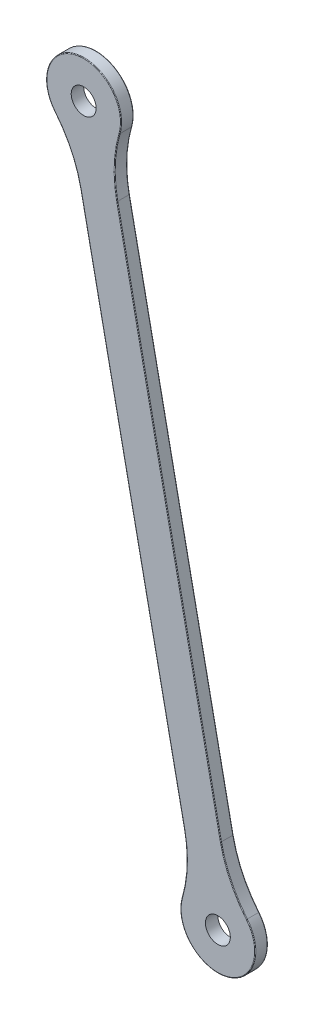
ISO-10303-21;
HEADER;
FILE_DESCRIPTION(('STEP AP214'),'2;1');
FILE_NAME('part.step','',(''),(''),'','','');
FILE_SCHEMA(('AUTOMOTIVE_DESIGN { 1 0 10303 214 1 1 1 1 }'));
ENDSEC;
DATA;
#1=APPLICATION_CONTEXT('core data for automotive mechanical design processes');
#2=APPLICATION_PROTOCOL_DEFINITION('international standard','automotive_design',2000,#1);
#3=PRODUCT_CONTEXT('',#1,'mechanical');
#4=PRODUCT('Part','Part','',(#3));
#5=PRODUCT_RELATED_PRODUCT_CATEGORY('part','',(#4));
#6=PRODUCT_DEFINITION_FORMATION('','',#4);
#7=PRODUCT_DEFINITION_CONTEXT('part definition',#1,'design');
#8=PRODUCT_DEFINITION('design','',#6,#7);
#9=PRODUCT_DEFINITION_SHAPE('','',#8);
#10=(LENGTH_UNIT() NAMED_UNIT(*) SI_UNIT(.MILLI.,.METRE.));
#11=(NAMED_UNIT(*) PLANE_ANGLE_UNIT() SI_UNIT($,.RADIAN.));
#12=(NAMED_UNIT(*) SI_UNIT($,.STERADIAN.) SOLID_ANGLE_UNIT());
#13=UNCERTAINTY_MEASURE_WITH_UNIT(LENGTH_MEASURE(1.E-05),#10,'distance_accuracy_value','');
#14=(GEOMETRIC_REPRESENTATION_CONTEXT(3) GLOBAL_UNCERTAINTY_ASSIGNED_CONTEXT((#13)) GLOBAL_UNIT_ASSIGNED_CONTEXT((#10,
#11,#12)) REPRESENTATION_CONTEXT('',''));
#15=CARTESIAN_POINT('',(0.,0.,0.));
#16=DIRECTION('',(0.,0.,1.));
#17=DIRECTION('',(1.,0.,0.));
#18=AXIS2_PLACEMENT_3D('',#15,#16,#17);
#19=CARTESIAN_POINT('',(39.2978914794172,8.10290704749419,-3.));
#20=DIRECTION('',(0.979397120277319,0.201943756507832,0.));
#21=DIRECTION('',(-0.201943756507832,0.979397120277319,0.));
#22=AXIS2_PLACEMENT_3D('',#19,#20,#21);
#23=PLANE('',#22);
#24=DIRECTION('',(0.,0.,1.));
#25=VECTOR('',#24,1.);
#26=CARTESIAN_POINT('',(25.6983866348893,74.0584785999702,-3.));
#27=LINE('',#26,#25);
#28=CARTESIAN_POINT('',(25.6983866348893,74.0584785999702,-2.85));
#29=VERTEX_POINT('',#28);
#30=CARTESIAN_POINT('',(25.6983866348893,74.0584785999702,-0.15));
#31=VERTEX_POINT('',#30);
#32=EDGE_CURVE('E283',#29,#31,#27,.T.);
#33=ORIENTED_EDGE('',*,*,#32,.T.);
#34=DIRECTION('',(-0.201943756507832,0.979397120277319,0.));
#35=VECTOR('',#34,1.);
#36=CARTESIAN_POINT('',(0.732699371036717,195.138340809095,-0.15));
#37=LINE('',#36,#35);
#38=CARTESIAN_POINT('',(0.732699371036753,195.138340809095,-0.15));
#39=VERTEX_POINT('',#38);
#40=EDGE_CURVE('E209',#31,#39,#37,.T.);
#41=ORIENTED_EDGE('',*,*,#40,.T.);
#42=DIRECTION('',(0.,0.,1.));
#43=VECTOR('',#42,1.);
#44=CARTESIAN_POINT('',(0.732699371036753,195.138340809095,-3.));
#45=LINE('',#44,#43);
#46=CARTESIAN_POINT('',(0.732699371036753,195.138340809095,-2.85));
#47=VERTEX_POINT('',#46);
#48=EDGE_CURVE('E278',#39,#47,#45,.F.);
#49=ORIENTED_EDGE('',*,*,#48,.T.);
#50=DIRECTION('',(-0.201943756507832,0.979397120277319,0.));
#51=VECTOR('',#50,1.);
#52=CARTESIAN_POINT('',(39.2978914794172,8.10290704749419,-2.85));
#53=LINE('',#52,#51);
#54=EDGE_CURVE('E207',#47,#29,#53,.F.);
#55=ORIENTED_EDGE('',*,*,#54,.T.);
#56=EDGE_LOOP('',(#33,#41,#49,#55));
#57=FACE_BOUND('',#56,.T.);
#58=ADVANCED_FACE('F34',(#57),#23,.F.);
#59=CARTESIAN_POINT('',(1.46732952358442,213.858926231003,-3.));
#60=DIRECTION('',(0.,0.,1.));
#61=DIRECTION('',(1.,0.,0.));
#62=AXIS2_PLACEMENT_3D('',#59,#60,#61);
#63=CYLINDRICAL_SURFACE('',#62,9.00000000000001);
#64=DIRECTION('',(0.,0.,1.));
#65=VECTOR('',#64,1.);
#66=CARTESIAN_POINT('',(-5.48264211353879,208.140718973201,-3.));
#67=LINE('',#66,#65);
#68=CARTESIAN_POINT('',(-5.48264211353879,208.140718973201,-2.85));
#69=VERTEX_POINT('',#68);
#70=CARTESIAN_POINT('',(-5.48264211353879,208.140718973201,-0.15));
#71=VERTEX_POINT('',#70);
#72=EDGE_CURVE('E167',#69,#71,#67,.T.);
#73=ORIENTED_EDGE('',*,*,#72,.T.);
#74=CARTESIAN_POINT('',(1.46732952358442,213.858926231003,-0.15));
#75=DIRECTION('',(0.,0.,1.));
#76=DIRECTION('',(1.,0.,0.));
#77=AXIS2_PLACEMENT_3D('',#74,#75,#76);
#78=CIRCLE('',#77,9.00000000000001);
#79=CARTESIAN_POINT('',(10.112373570877,211.35628494221,-0.15));
#80=VERTEX_POINT('',#79);
#81=EDGE_CURVE('E184',#71,#80,#78,.F.);
#82=ORIENTED_EDGE('',*,*,#81,.T.);
#83=DIRECTION('',(0.,0.,1.));
#84=VECTOR('',#83,1.);
#85=CARTESIAN_POINT('',(10.112373570877,211.35628494221,-3.));
#86=LINE('',#85,#84);
#87=CARTESIAN_POINT('',(10.112373570877,211.35628494221,-2.85));
#88=VERTEX_POINT('',#87);
#89=EDGE_CURVE('E286',#80,#88,#86,.F.);
#90=ORIENTED_EDGE('',*,*,#89,.T.);
#91=CARTESIAN_POINT('',(1.46732952358442,213.858926231003,-2.85));
#92=DIRECTION('',(0.,0.,1.));
#93=DIRECTION('',(1.,0.,0.));
#94=AXIS2_PLACEMENT_3D('',#91,#92,#93);
#95=CIRCLE('',#94,9.00000000000001);
#96=EDGE_CURVE('E182',#88,#69,#95,.T.);
#97=ORIENTED_EDGE('',*,*,#96,.T.);
#98=EDGE_LOOP('',(#73,#82,#90,#97));
#99=FACE_BOUND('',#98,.T.);
#100=ADVANCED_FACE('F314',(#99),#63,.T.);
#101=CARTESIAN_POINT('',(48.1124655619131,9.92040085606468,-3.));
#102=DIRECTION('',(0.979397120277319,0.201943756507832,0.));
#103=DIRECTION('',(-0.201943756507832,0.979397120277319,0.));
#104=AXIS2_PLACEMENT_3D('',#101,#102,#103);
#105=PLANE('',#104);
#106=DIRECTION('',(0.,0.,-1.));
#107=VECTOR('',#106,1.);
#108=CARTESIAN_POINT('',(9.54727345353264,196.955834617665,0.));
#109=LINE('',#108,#107);
#110=CARTESIAN_POINT('',(9.54727345353264,196.955834617665,-2.85));
#111=VERTEX_POINT('',#110);
#112=CARTESIAN_POINT('',(9.54727345353264,196.955834617665,-0.15));
#113=VERTEX_POINT('',#112);
#114=EDGE_CURVE('E289',#111,#113,#109,.F.);
#115=ORIENTED_EDGE('',*,*,#114,.T.);
#116=DIRECTION('',(-0.201943756507832,0.979397120277319,0.));
#117=VECTOR('',#116,1.);
#118=CARTESIAN_POINT('',(48.1124655619131,9.92040085606468,-0.15));
#119=LINE('',#118,#117);
#120=CARTESIAN_POINT('',(34.5129607173852,75.8759724085406,-0.15));
#121=VERTEX_POINT('',#120);
#122=EDGE_CURVE('E192',#113,#121,#119,.F.);
#123=ORIENTED_EDGE('',*,*,#122,.T.);
#124=DIRECTION('',(0.,0.,-1.));
#125=VECTOR('',#124,1.);
#126=CARTESIAN_POINT('',(34.5129607173852,75.8759724085406,-3.));
#127=LINE('',#126,#125);
#128=CARTESIAN_POINT('',(34.5129607173852,75.8759724085406,-2.85));
#129=VERTEX_POINT('',#128);
#130=EDGE_CURVE('E284',#121,#129,#127,.T.);
#131=ORIENTED_EDGE('',*,*,#130,.T.);
#132=DIRECTION('',(-0.201943756507832,0.979397120277319,0.));
#133=VECTOR('',#132,1.);
#134=CARTESIAN_POINT('',(9.5472734535326,196.955834617666,-2.85));
#135=LINE('',#134,#133);
#136=EDGE_CURVE('E190',#129,#111,#135,.T.);
#137=ORIENTED_EDGE('',*,*,#136,.T.);
#138=EDGE_LOOP('',(#115,#123,#131,#137));
#139=FACE_BOUND('',#138,.T.);
#140=ADVANCED_FACE('F386',(#139),#105,.T.);
#141=CARTESIAN_POINT('',(33.7783305648375,57.1553869866323,-3.));
#142=DIRECTION('',(0.,0.,1.));
#143=DIRECTION('',(1.,0.,0.));
#144=AXIS2_PLACEMENT_3D('',#141,#142,#143);
#145=CYLINDRICAL_SURFACE('',#144,9.);
#146=DIRECTION('',(0.,0.,1.));
#147=VECTOR('',#146,1.);
#148=CARTESIAN_POINT('',(40.7283022019607,62.8735942444346,-3.));
#149=LINE('',#148,#147);
#150=CARTESIAN_POINT('',(40.7283022019607,62.8735942444346,-2.85));
#151=VERTEX_POINT('',#150);
#152=CARTESIAN_POINT('',(40.7283022019607,62.8735942444346,-0.15));
#153=VERTEX_POINT('',#152);
#154=EDGE_CURVE('E347',#151,#153,#149,.T.);
#155=ORIENTED_EDGE('',*,*,#154,.T.);
#156=CARTESIAN_POINT('',(33.7783305648375,57.1553869866323,-0.15));
#157=DIRECTION('',(0.,0.,1.));
#158=DIRECTION('',(1.,0.,0.));
#159=AXIS2_PLACEMENT_3D('',#156,#157,#158);
#160=CIRCLE('',#159,9.);
#161=CARTESIAN_POINT('',(25.1332865175449,59.6580282754253,-0.15));
#162=VERTEX_POINT('',#161);
#163=EDGE_CURVE('E201',#153,#162,#160,.F.);
#164=ORIENTED_EDGE('',*,*,#163,.T.);
#165=DIRECTION('',(0.,0.,1.));
#166=VECTOR('',#165,1.);
#167=CARTESIAN_POINT('',(25.1332865175449,59.6580282754253,-3.));
#168=LINE('',#167,#166);
#169=CARTESIAN_POINT('',(25.1332865175449,59.6580282754253,-2.85));
#170=VERTEX_POINT('',#169);
#171=EDGE_CURVE('E240',#162,#170,#168,.F.);
#172=ORIENTED_EDGE('',*,*,#171,.T.);
#173=CARTESIAN_POINT('',(33.7783305648375,57.1553869866323,-2.85));
#174=DIRECTION('',(0.,0.,1.));
#175=DIRECTION('',(1.,0.,0.));
#176=AXIS2_PLACEMENT_3D('',#173,#174,#175);
#177=CIRCLE('',#176,9.);
#178=EDGE_CURVE('E199',#170,#151,#177,.T.);
#179=ORIENTED_EDGE('',*,*,#178,.T.);
#180=EDGE_LOOP('',(#155,#164,#172,#179));
#181=FACE_BOUND('',#180,.T.);
#182=ADVANCED_FACE('F346',(#181),#145,.T.);
#183=CARTESIAN_POINT('',(0.,0.,-3.));
#184=DIRECTION('',(0.,0.,1.));
#185=DIRECTION('',(1.,0.,0.));
#186=AXIS2_PLACEMENT_3D('',#183,#184,#185);
#187=PLANE('',#186);
#188=DIRECTION('',(-0.201943756507832,0.979397120277319,0.));
#189=VECTOR('',#188,1.);
#190=CARTESIAN_POINT('',(34.3660511493436,75.8456808450645,-3.));
#191=LINE('',#190,#189);
#192=CARTESIAN_POINT('',(9.40036388549103,196.925543054189,-3.));
#193=VERTEX_POINT('',#192);
#194=CARTESIAN_POINT('',(34.3660511493436,75.8456808450644,-3.));
#195=VERTEX_POINT('',#194);
#196=EDGE_CURVE('E43',#193,#195,#191,.F.);
#197=ORIENTED_EDGE('',*,*,#196,.T.);
#198=CARTESIAN_POINT('',(63.8948743257047,81.9342851037755,-3.));
#199=DIRECTION('',(0.,0.,1.));
#200=DIRECTION('',(1.,0.,0.));
#201=AXIS2_PLACEMENT_3D('',#198,#199,#200);
#202=CIRCLE('',#201,30.15);
#203=CARTESIAN_POINT('',(40.612469341342,62.7782907901379,-3.));
#204=VERTEX_POINT('',#203);
#205=EDGE_CURVE('E11',#195,#204,#202,.T.);
#206=ORIENTED_EDGE('',*,*,#205,.T.);
#207=CARTESIAN_POINT('',(33.7783305648375,57.1553869866323,-3.));
#208=DIRECTION('',(0.,0.,1.));
#209=DIRECTION('',(1.,0.,0.));
#210=AXIS2_PLACEMENT_3D('',#207,#208,#209);
#211=CIRCLE('',#210,8.85);
#212=CARTESIAN_POINT('',(25.2773705849998,59.6163175872787,-3.));
#213=VERTEX_POINT('',#212);
#214=EDGE_CURVE('E211',#204,#213,#211,.F.);
#215=ORIENTED_EDGE('',*,*,#214,.T.);
#216=CARTESIAN_POINT('',(-3.6835269734303,68.0001659047352,-3.));
#217=DIRECTION('',(0.,0.,1.));
#218=DIRECTION('',(1.,0.,0.));
#219=AXIS2_PLACEMENT_3D('',#216,#217,#218);
#220=CIRCLE('',#219,30.15);
#221=CARTESIAN_POINT('',(25.8452962029309,74.0887701634463,-3.));
#222=VERTEX_POINT('',#221);
#223=EDGE_CURVE('E213',#213,#222,#220,.T.);
#224=ORIENTED_EDGE('',*,*,#223,.T.);
#225=DIRECTION('',(-0.201943756507832,0.979397120277319,0.));
#226=VECTOR('',#225,1.);
#227=CARTESIAN_POINT('',(39.4448010474588,8.13319861097037,-3.));
#228=LINE('',#227,#226);
#229=CARTESIAN_POINT('',(0.87960893907836,195.168632372571,-3.));
#230=VERTEX_POINT('',#229);
#231=EDGE_CURVE('E215',#222,#230,#228,.T.);
#232=ORIENTED_EDGE('',*,*,#231,.T.);
#233=CARTESIAN_POINT('',(-28.6492142372828,189.08002811386,-3.));
#234=DIRECTION('',(0.,0.,1.));
#235=DIRECTION('',(1.,0.,0.));
#236=AXIS2_PLACEMENT_3D('',#233,#234,#235);
#237=CIRCLE('',#236,30.15);
#238=CARTESIAN_POINT('',(-5.36680925292007,208.236022427498,-3.));
#239=VERTEX_POINT('',#238);
#240=EDGE_CURVE('E217',#230,#239,#237,.T.);
#241=ORIENTED_EDGE('',*,*,#240,.T.);
#242=CARTESIAN_POINT('',(1.46732952358442,213.858926231003,-3.));
#243=DIRECTION('',(0.,0.,1.));
#244=DIRECTION('',(1.,0.,0.));
#245=AXIS2_PLACEMENT_3D('',#242,#243,#244);
#246=CIRCLE('',#245,8.85);
#247=CARTESIAN_POINT('',(9.9682895034221,211.397995630357,-3.));
#248=VERTEX_POINT('',#247);
#249=EDGE_CURVE('E219',#239,#248,#246,.F.);
#250=ORIENTED_EDGE('',*,*,#249,.T.);
#251=CARTESIAN_POINT('',(38.9291870618522,203.0141473129,-3.));
#252=DIRECTION('',(0.,0.,1.));
#253=DIRECTION('',(1.,0.,0.));
#254=AXIS2_PLACEMENT_3D('',#251,#252,#253);
#255=CIRCLE('',#254,30.15);
#256=EDGE_CURVE('E54',#248,#193,#255,.T.);
#257=ORIENTED_EDGE('',*,*,#256,.T.);
#258=EDGE_LOOP('',(#197,#206,#215,#224,#232,#241,#250,#257));
#259=FACE_BOUND('',#258,.T.);
#260=CARTESIAN_POINT('',(1.46732952358442,213.858926231003,-3.));
#261=DIRECTION('',(0.,0.,1.));
#262=DIRECTION('',(1.,0.,0.));
#263=AXIS2_PLACEMENT_3D('',#260,#261,#262);
#264=CIRCLE('',#263,3.);
#265=CARTESIAN_POINT('',(4.46732952358442,213.858926231003,-3.));
#266=VERTEX_POINT('',#265);
#267=EDGE_CURVE('E244',#266,#266,#264,.F.);
#268=ORIENTED_EDGE('',*,*,#267,.F.);
#269=EDGE_LOOP('',(#268));
#270=FACE_BOUND('',#269,.T.);
#271=CARTESIAN_POINT('',(33.7783305648375,57.1553869866323,-3.));
#272=DIRECTION('',(0.,0.,1.));
#273=DIRECTION('',(1.,0.,0.));
#274=AXIS2_PLACEMENT_3D('',#271,#272,#273);
#275=CIRCLE('',#274,3.);
#276=CARTESIAN_POINT('',(36.7783305648375,57.1553869866323,-3.));
#277=VERTEX_POINT('',#276);
#278=EDGE_CURVE('E362',#277,#277,#275,.F.);
#279=ORIENTED_EDGE('',*,*,#278,.F.);
#280=EDGE_LOOP('',(#279));
#281=FACE_BOUND('',#280,.T.);
#282=ADVANCED_FACE('F331',(#259,#270,#281),#187,.F.);
#283=CARTESIAN_POINT('',(0.,0.,0.));
#284=DIRECTION('',(0.,0.,1.));
#285=DIRECTION('',(1.,0.,0.));
#286=AXIS2_PLACEMENT_3D('',#283,#284,#285);
#287=PLANE('',#286);
#288=CARTESIAN_POINT('',(1.46732952358442,213.858926231003,0.));
#289=DIRECTION('',(0.,0.,1.));
#290=DIRECTION('',(1.,0.,0.));
#291=AXIS2_PLACEMENT_3D('',#288,#289,#290);
#292=CIRCLE('',#291,8.85);
#293=CARTESIAN_POINT('',(9.96828950342212,211.397995630357,0.));
#294=VERTEX_POINT('',#293);
#295=CARTESIAN_POINT('',(-5.36680925292007,208.236022427498,0.));
#296=VERTEX_POINT('',#295);
#297=EDGE_CURVE('E172',#294,#296,#292,.T.);
#298=ORIENTED_EDGE('',*,*,#297,.T.);
#299=CARTESIAN_POINT('',(-28.6492142372828,189.08002811386,0.));
#300=DIRECTION('',(0.,0.,1.));
#301=DIRECTION('',(1.,0.,0.));
#302=AXIS2_PLACEMENT_3D('',#299,#300,#301);
#303=CIRCLE('',#302,30.15);
#304=CARTESIAN_POINT('',(0.879608939078351,195.168632372571,0.));
#305=VERTEX_POINT('',#304);
#306=EDGE_CURVE('E152',#296,#305,#303,.F.);
#307=ORIENTED_EDGE('',*,*,#306,.T.);
#308=DIRECTION('',(-0.201943756507832,0.979397120277319,0.));
#309=VECTOR('',#308,1.);
#310=CARTESIAN_POINT('',(25.8452962029309,74.0887701634464,0.));
#311=LINE('',#310,#309);
#312=CARTESIAN_POINT('',(25.8452962029309,74.0887701634463,0.));
#313=VERTEX_POINT('',#312);
#314=EDGE_CURVE('E160',#305,#313,#311,.F.);
#315=ORIENTED_EDGE('',*,*,#314,.T.);
#316=CARTESIAN_POINT('',(-3.6835269734303,68.0001659047352,0.));
#317=DIRECTION('',(0.,0.,1.));
#318=DIRECTION('',(1.,0.,0.));
#319=AXIS2_PLACEMENT_3D('',#316,#317,#318);
#320=CIRCLE('',#319,30.15);
#321=CARTESIAN_POINT('',(25.2773705849998,59.6163175872787,0.));
#322=VERTEX_POINT('',#321);
#323=EDGE_CURVE('E166',#313,#322,#320,.F.);
#324=ORIENTED_EDGE('',*,*,#323,.T.);
#325=CARTESIAN_POINT('',(33.7783305648375,57.1553869866323,0.));
#326=DIRECTION('',(0.,0.,1.));
#327=DIRECTION('',(1.,0.,0.));
#328=AXIS2_PLACEMENT_3D('',#325,#326,#327);
#329=CIRCLE('',#328,8.85);
#330=CARTESIAN_POINT('',(40.612469341342,62.7782907901379,0.));
#331=VERTEX_POINT('',#330);
#332=EDGE_CURVE('E297',#322,#331,#329,.T.);
#333=ORIENTED_EDGE('',*,*,#332,.T.);
#334=CARTESIAN_POINT('',(63.8948743257047,81.9342851037755,0.));
#335=DIRECTION('',(0.,0.,1.));
#336=DIRECTION('',(1.,0.,0.));
#337=AXIS2_PLACEMENT_3D('',#334,#335,#336);
#338=CIRCLE('',#337,30.15);
#339=CARTESIAN_POINT('',(34.3660511493436,75.8456808450644,0.));
#340=VERTEX_POINT('',#339);
#341=EDGE_CURVE('E299',#331,#340,#338,.F.);
#342=ORIENTED_EDGE('',*,*,#341,.T.);
#343=DIRECTION('',(-0.201943756507832,0.979397120277319,0.));
#344=VECTOR('',#343,1.);
#345=CARTESIAN_POINT('',(47.9655559938715,9.89010929258851,0.));
#346=LINE('',#345,#344);
#347=CARTESIAN_POINT('',(9.40036388549104,196.925543054189,0.));
#348=VERTEX_POINT('',#347);
#349=EDGE_CURVE('E301',#340,#348,#346,.T.);
#350=ORIENTED_EDGE('',*,*,#349,.T.);
#351=CARTESIAN_POINT('',(38.9291870618522,203.0141473129,0.));
#352=DIRECTION('',(0.,0.,1.));
#353=DIRECTION('',(1.,0.,0.));
#354=AXIS2_PLACEMENT_3D('',#351,#352,#353);
#355=CIRCLE('',#354,30.15);
#356=EDGE_CURVE('E177',#348,#294,#355,.F.);
#357=ORIENTED_EDGE('',*,*,#356,.T.);
#358=EDGE_LOOP('',(#298,#307,#315,#324,#333,#342,#350,#357));
#359=FACE_BOUND('',#358,.T.);
#360=CARTESIAN_POINT('',(1.46732952358442,213.858926231003,0.));
#361=DIRECTION('',(0.,0.,1.));
#362=DIRECTION('',(1.,0.,0.));
#363=AXIS2_PLACEMENT_3D('',#360,#361,#362);
#364=CIRCLE('',#363,3.);
#365=CARTESIAN_POINT('',(4.46732952358442,213.858926231003,0.));
#366=VERTEX_POINT('',#365);
#367=EDGE_CURVE('E359',#366,#366,#364,.T.);
#368=ORIENTED_EDGE('',*,*,#367,.F.);
#369=EDGE_LOOP('',(#368));
#370=FACE_BOUND('',#369,.T.);
#371=CARTESIAN_POINT('',(33.7783305648375,57.1553869866323,0.));
#372=DIRECTION('',(0.,0.,1.));
#373=DIRECTION('',(1.,0.,0.));
#374=AXIS2_PLACEMENT_3D('',#371,#372,#373);
#375=CIRCLE('',#374,3.);
#376=CARTESIAN_POINT('',(36.7783305648375,57.1553869866323,0.));
#377=VERTEX_POINT('',#376);
#378=EDGE_CURVE('E365',#377,#377,#375,.T.);
#379=ORIENTED_EDGE('',*,*,#378,.F.);
#380=EDGE_LOOP('',(#379));
#381=FACE_BOUND('',#380,.T.);
#382=ADVANCED_FACE('F169',(#359,#370,#381),#287,.T.);
#383=CARTESIAN_POINT('',(63.8948743257047,81.9342851037755,-3.));
#384=DIRECTION('',(0.,0.,1.));
#385=DIRECTION('',(1.,0.,0.));
#386=AXIS2_PLACEMENT_3D('',#383,#384,#385);
#387=CYLINDRICAL_SURFACE('',#386,30.);
#388=ORIENTED_EDGE('',*,*,#130,.F.);
#389=CARTESIAN_POINT('',(63.8948743257047,81.9342851037755,-0.15));
#390=DIRECTION('',(0.,0.,1.));
#391=DIRECTION('',(1.,0.,0.));
#392=AXIS2_PLACEMENT_3D('',#389,#390,#391);
#393=CIRCLE('',#392,30.);
#394=EDGE_CURVE('E197',#121,#153,#393,.T.);
#395=ORIENTED_EDGE('',*,*,#394,.T.);
#396=ORIENTED_EDGE('',*,*,#154,.F.);
#397=CARTESIAN_POINT('',(63.8948743257047,81.9342851037755,-2.85));
#398=DIRECTION('',(0.,0.,1.));
#399=DIRECTION('',(1.,0.,0.));
#400=AXIS2_PLACEMENT_3D('',#397,#398,#399);
#401=CIRCLE('',#400,30.);
#402=EDGE_CURVE('E194',#151,#129,#401,.F.);
#403=ORIENTED_EDGE('',*,*,#402,.T.);
#404=EDGE_LOOP('',(#388,#395,#396,#403));
#405=FACE_BOUND('',#404,.T.);
#406=ADVANCED_FACE('F352',(#405),#387,.F.);
#407=CARTESIAN_POINT('',(-3.6835269734303,68.0001659047352,-3.));
#408=DIRECTION('',(0.,0.,1.));
#409=DIRECTION('',(1.,0.,0.));
#410=AXIS2_PLACEMENT_3D('',#407,#408,#409);
#411=CYLINDRICAL_SURFACE('',#410,30.);
#412=ORIENTED_EDGE('',*,*,#171,.F.);
#413=CARTESIAN_POINT('',(-3.6835269734303,68.0001659047352,-0.15));
#414=DIRECTION('',(0.,0.,1.));
#415=DIRECTION('',(1.,0.,0.));
#416=AXIS2_PLACEMENT_3D('',#413,#414,#415);
#417=CIRCLE('',#416,30.);
#418=EDGE_CURVE('E205',#162,#31,#417,.T.);
#419=ORIENTED_EDGE('',*,*,#418,.T.);
#420=ORIENTED_EDGE('',*,*,#32,.F.);
#421=CARTESIAN_POINT('',(-3.6835269734303,68.0001659047352,-2.85));
#422=DIRECTION('',(0.,0.,1.));
#423=DIRECTION('',(1.,0.,0.));
#424=AXIS2_PLACEMENT_3D('',#421,#422,#423);
#425=CIRCLE('',#424,30.);
#426=EDGE_CURVE('E203',#29,#170,#425,.F.);
#427=ORIENTED_EDGE('',*,*,#426,.T.);
#428=EDGE_LOOP('',(#412,#419,#420,#427));
#429=FACE_BOUND('',#428,.T.);
#430=ADVANCED_FACE('F377',(#429),#411,.F.);
#431=CARTESIAN_POINT('',(-28.6492142372828,189.08002811386,-3.));
#432=DIRECTION('',(0.,0.,1.));
#433=DIRECTION('',(1.,0.,0.));
#434=AXIS2_PLACEMENT_3D('',#431,#432,#433);
#435=CYLINDRICAL_SURFACE('',#434,30.);
#436=ORIENTED_EDGE('',*,*,#48,.F.);
#437=CARTESIAN_POINT('',(-28.6492142372828,189.08002811386,-0.15));
#438=DIRECTION('',(0.,0.,1.));
#439=DIRECTION('',(1.,0.,0.));
#440=AXIS2_PLACEMENT_3D('',#437,#438,#439);
#441=CIRCLE('',#440,30.);
#442=EDGE_CURVE('E154',#39,#71,#441,.T.);
#443=ORIENTED_EDGE('',*,*,#442,.T.);
#444=ORIENTED_EDGE('',*,*,#72,.F.);
#445=CARTESIAN_POINT('',(-28.6492142372828,189.08002811386,-2.85));
#446=DIRECTION('',(0.,0.,1.));
#447=DIRECTION('',(1.,0.,0.));
#448=AXIS2_PLACEMENT_3D('',#445,#446,#447);
#449=CIRCLE('',#448,30.);
#450=EDGE_CURVE('E174',#69,#47,#449,.F.);
#451=ORIENTED_EDGE('',*,*,#450,.T.);
#452=EDGE_LOOP('',(#436,#443,#444,#451));
#453=FACE_BOUND('',#452,.T.);
#454=ADVANCED_FACE('F277',(#453),#435,.F.);
#455=CARTESIAN_POINT('',(38.9291870618522,203.0141473129,-3.));
#456=DIRECTION('',(0.,0.,1.));
#457=DIRECTION('',(1.,0.,0.));
#458=AXIS2_PLACEMENT_3D('',#455,#456,#457);
#459=CYLINDRICAL_SURFACE('',#458,30.);
#460=ORIENTED_EDGE('',*,*,#89,.F.);
#461=CARTESIAN_POINT('',(38.9291870618522,203.0141473129,-0.15));
#462=DIRECTION('',(0.,0.,1.));
#463=DIRECTION('',(1.,0.,0.));
#464=AXIS2_PLACEMENT_3D('',#461,#462,#463);
#465=CIRCLE('',#464,30.);
#466=EDGE_CURVE('E188',#80,#113,#465,.T.);
#467=ORIENTED_EDGE('',*,*,#466,.T.);
#468=ORIENTED_EDGE('',*,*,#114,.F.);
#469=CARTESIAN_POINT('',(38.9291870618522,203.0141473129,-2.85));
#470=DIRECTION('',(0.,0.,1.));
#471=DIRECTION('',(1.,0.,0.));
#472=AXIS2_PLACEMENT_3D('',#469,#470,#471);
#473=CIRCLE('',#472,30.);
#474=EDGE_CURVE('E186',#111,#88,#473,.F.);
#475=ORIENTED_EDGE('',*,*,#474,.T.);
#476=EDGE_LOOP('',(#460,#467,#468,#475));
#477=FACE_BOUND('',#476,.T.);
#478=ADVANCED_FACE('F316',(#477),#459,.F.);
#479=CARTESIAN_POINT('',(63.8948743257047,81.9342851037755,-0.15));
#480=DIRECTION('',(0.,0.,1.));
#481=DIRECTION('',(1.,0.,0.));
#482=AXIS2_PLACEMENT_3D('',#479,#480,#481);
#483=TOROIDAL_SURFACE('',#482,30.15,0.15);
#484=CARTESIAN_POINT('',(40.612469341342,62.7782907901379,-0.15));
#485=DIRECTION('',(0.635356361978029,-0.772219070791472,0.));
#486=DIRECTION('',(0.772219070791472,0.635356361978029,0.));
#487=AXIS2_PLACEMENT_3D('',#484,#485,#486);
#488=CIRCLE('',#487,0.15);
#489=EDGE_CURVE('E234',#153,#331,#488,.T.);
#490=ORIENTED_EDGE('',*,*,#489,.F.);
#491=ORIENTED_EDGE('',*,*,#394,.F.);
#492=CARTESIAN_POINT('',(34.3660511493436,75.8456808450644,-0.15));
#493=DIRECTION('',(-0.201943756507799,0.979397120277326,0.));
#494=DIRECTION('',(-0.979397120277326,-0.201943756507799,0.));
#495=AXIS2_PLACEMENT_3D('',#492,#493,#494);
#496=CIRCLE('',#495,0.15);
#497=EDGE_CURVE('E237',#340,#121,#496,.T.);
#498=ORIENTED_EDGE('',*,*,#497,.F.);
#499=ORIENTED_EDGE('',*,*,#341,.F.);
#500=EDGE_LOOP('',(#490,#491,#498,#499));
#501=FACE_BOUND('',#500,.T.);
#502=ADVANCED_FACE('F397',(#501),#483,.T.);
#503=CARTESIAN_POINT('',(47.9655559938715,9.89010929258851,-0.15));
#504=DIRECTION('',(-0.201943756507832,0.979397120277319,0.));
#505=DIRECTION('',(-0.979397120277319,-0.201943756507832,0.));
#506=AXIS2_PLACEMENT_3D('',#503,#504,#505);
#507=CYLINDRICAL_SURFACE('',#506,0.15);
#508=ORIENTED_EDGE('',*,*,#497,.T.);
#509=ORIENTED_EDGE('',*,*,#122,.F.);
#510=CARTESIAN_POINT('',(9.40036388549104,196.925543054189,-0.15));
#511=DIRECTION('',(-0.201943756507806,0.979397120277324,0.));
#512=DIRECTION('',(-0.979397120277325,-0.201943756507806,0.));
#513=AXIS2_PLACEMENT_3D('',#510,#511,#512);
#514=CIRCLE('',#513,0.15);
#515=EDGE_CURVE('E231',#348,#113,#514,.T.);
#516=ORIENTED_EDGE('',*,*,#515,.F.);
#517=ORIENTED_EDGE('',*,*,#349,.F.);
#518=EDGE_LOOP('',(#508,#509,#516,#517));
#519=FACE_BOUND('',#518,.T.);
#520=ADVANCED_FACE('F413',(#519),#507,.T.);
#521=CARTESIAN_POINT('',(33.7783305648375,57.1553869866323,-0.15));
#522=DIRECTION('',(0.,0.,1.));
#523=DIRECTION('',(1.,0.,0.));
#524=AXIS2_PLACEMENT_3D('',#521,#522,#523);
#525=TOROIDAL_SURFACE('',#524,8.85,0.15);
#526=ORIENTED_EDGE('',*,*,#489,.T.);
#527=ORIENTED_EDGE('',*,*,#332,.F.);
#528=CARTESIAN_POINT('',(25.2773705849998,59.6163175872787,-0.15));
#529=DIRECTION('',(0.278071254310312,0.960560449699179,0.));
#530=DIRECTION('',(-0.96056044969918,0.278071254310312,0.));
#531=AXIS2_PLACEMENT_3D('',#528,#529,#530);
#532=CIRCLE('',#531,0.15);
#533=EDGE_CURVE('E228',#162,#322,#532,.T.);
#534=ORIENTED_EDGE('',*,*,#533,.F.);
#535=ORIENTED_EDGE('',*,*,#163,.F.);
#536=EDGE_LOOP('',(#526,#527,#534,#535));
#537=FACE_BOUND('',#536,.T.);
#538=ADVANCED_FACE('F410',(#537),#525,.T.);
#539=CARTESIAN_POINT('',(38.9291870618522,203.0141473129,-0.15));
#540=DIRECTION('',(0.,0.,1.));
#541=DIRECTION('',(1.,0.,0.));
#542=AXIS2_PLACEMENT_3D('',#539,#540,#541);
#543=TOROIDAL_SURFACE('',#542,30.15,0.15);
#544=ORIENTED_EDGE('',*,*,#515,.T.);
#545=ORIENTED_EDGE('',*,*,#466,.F.);
#546=CARTESIAN_POINT('',(9.96828950342212,211.397995630357,-0.15));
#547=DIRECTION('',(0.278071254310269,0.960560449699192,0.));
#548=DIRECTION('',(-0.960560449699192,0.278071254310269,0.));
#549=AXIS2_PLACEMENT_3D('',#546,#547,#548);
#550=CIRCLE('',#549,0.15);
#551=EDGE_CURVE('E225',#294,#80,#550,.T.);
#552=ORIENTED_EDGE('',*,*,#551,.F.);
#553=ORIENTED_EDGE('',*,*,#356,.F.);
#554=EDGE_LOOP('',(#544,#545,#552,#553));
#555=FACE_BOUND('',#554,.T.);
#556=ADVANCED_FACE('F308',(#555),#543,.T.);
#557=CARTESIAN_POINT('',(-3.6835269734303,68.0001659047352,-0.15));
#558=DIRECTION('',(0.,0.,1.));
#559=DIRECTION('',(1.,0.,0.));
#560=AXIS2_PLACEMENT_3D('',#557,#558,#559);
#561=TOROIDAL_SURFACE('',#560,30.15,0.15);
#562=ORIENTED_EDGE('',*,*,#533,.T.);
#563=ORIENTED_EDGE('',*,*,#323,.F.);
#564=CARTESIAN_POINT('',(25.8452962029309,74.0887701634463,-0.15));
#565=DIRECTION('',(-0.201943756507804,0.979397120277325,0.));
#566=DIRECTION('',(-0.979397120277325,-0.201943756507804,0.));
#567=AXIS2_PLACEMENT_3D('',#564,#565,#566);
#568=CIRCLE('',#567,0.15);
#569=EDGE_CURVE('E163',#31,#313,#568,.T.);
#570=ORIENTED_EDGE('',*,*,#569,.F.);
#571=ORIENTED_EDGE('',*,*,#418,.F.);
#572=EDGE_LOOP('',(#562,#563,#570,#571));
#573=FACE_BOUND('',#572,.T.);
#574=ADVANCED_FACE('F404',(#573),#561,.T.);
#575=CARTESIAN_POINT('',(1.46732952358442,213.858926231003,-0.15));
#576=DIRECTION('',(0.,0.,1.));
#577=DIRECTION('',(1.,0.,0.));
#578=AXIS2_PLACEMENT_3D('',#575,#576,#577);
#579=TOROIDAL_SURFACE('',#578,8.85,0.15);
#580=ORIENTED_EDGE('',*,*,#551,.T.);
#581=ORIENTED_EDGE('',*,*,#81,.F.);
#582=CARTESIAN_POINT('',(-5.36680925292007,208.236022427498,-0.15));
#583=DIRECTION('',(0.635356361978009,-0.772219070791488,0.));
#584=DIRECTION('',(0.772219070791488,0.635356361978009,0.));
#585=AXIS2_PLACEMENT_3D('',#582,#583,#584);
#586=CIRCLE('',#585,0.15);
#587=EDGE_CURVE('E157',#296,#71,#586,.T.);
#588=ORIENTED_EDGE('',*,*,#587,.F.);
#589=ORIENTED_EDGE('',*,*,#297,.F.);
#590=EDGE_LOOP('',(#580,#581,#588,#589));
#591=FACE_BOUND('',#590,.T.);
#592=ADVANCED_FACE('F311',(#591),#579,.T.);
#593=CARTESIAN_POINT('',(39.4448010474588,8.13319861097037,-0.15));
#594=DIRECTION('',(0.201943756507832,-0.979397120277319,0.));
#595=DIRECTION('',(0.979397120277319,0.201943756507832,0.));
#596=AXIS2_PLACEMENT_3D('',#593,#594,#595);
#597=CYLINDRICAL_SURFACE('',#596,0.15);
#598=ORIENTED_EDGE('',*,*,#569,.T.);
#599=ORIENTED_EDGE('',*,*,#314,.F.);
#600=CARTESIAN_POINT('',(0.879608939078351,195.168632372571,-0.15));
#601=DIRECTION('',(-0.201943756507803,0.979397120277325,0.));
#602=DIRECTION('',(-0.979397120277325,-0.201943756507803,0.));
#603=AXIS2_PLACEMENT_3D('',#600,#601,#602);
#604=CIRCLE('',#603,0.15);
#605=EDGE_CURVE('E148',#39,#305,#604,.T.);
#606=ORIENTED_EDGE('',*,*,#605,.F.);
#607=ORIENTED_EDGE('',*,*,#40,.F.);
#608=EDGE_LOOP('',(#598,#599,#606,#607));
#609=FACE_BOUND('',#608,.T.);
#610=ADVANCED_FACE('F161',(#609),#597,.T.);
#611=CARTESIAN_POINT('',(-28.6492142372828,189.08002811386,-0.15));
#612=DIRECTION('',(0.,0.,1.));
#613=DIRECTION('',(1.,0.,0.));
#614=AXIS2_PLACEMENT_3D('',#611,#612,#613);
#615=TOROIDAL_SURFACE('',#614,30.15,0.15);
#616=ORIENTED_EDGE('',*,*,#587,.T.);
#617=ORIENTED_EDGE('',*,*,#442,.F.);
#618=ORIENTED_EDGE('',*,*,#605,.T.);
#619=ORIENTED_EDGE('',*,*,#306,.F.);
#620=EDGE_LOOP('',(#616,#617,#618,#619));
#621=FACE_BOUND('',#620,.T.);
#622=ADVANCED_FACE('F150',(#621),#615,.T.);
#623=CARTESIAN_POINT('',(-28.6492142372828,189.08002811386,-2.85));
#624=DIRECTION('',(0.,0.,1.));
#625=DIRECTION('',(1.,0.,0.));
#626=AXIS2_PLACEMENT_3D('',#623,#624,#625);
#627=TOROIDAL_SURFACE('',#626,30.15,0.15);
#628=CARTESIAN_POINT('',(0.879608939078351,195.168632372571,-2.85));
#629=DIRECTION('',(0.201943756507803,-0.979397120277325,0.));
#630=DIRECTION('',(0.979397120277325,0.201943756507803,0.));
#631=AXIS2_PLACEMENT_3D('',#628,#629,#630);
#632=CIRCLE('',#631,0.15);
#633=EDGE_CURVE('E257',#47,#230,#632,.T.);
#634=ORIENTED_EDGE('',*,*,#633,.F.);
#635=ORIENTED_EDGE('',*,*,#450,.F.);
#636=CARTESIAN_POINT('',(-5.36680925292007,208.236022427498,-2.85));
#637=DIRECTION('',(-0.635356361978,0.772219070791495,0.));
#638=DIRECTION('',(-0.772219070791495,-0.635356361978,0.));
#639=AXIS2_PLACEMENT_3D('',#636,#637,#638);
#640=CIRCLE('',#639,0.15);
#641=EDGE_CURVE('E38',#239,#69,#640,.T.);
#642=ORIENTED_EDGE('',*,*,#641,.F.);
#643=ORIENTED_EDGE('',*,*,#240,.F.);
#644=EDGE_LOOP('',(#634,#635,#642,#643));
#645=FACE_BOUND('',#644,.T.);
#646=ADVANCED_FACE('F36',(#645),#627,.T.);
#647=CARTESIAN_POINT('',(1.46732952358442,213.858926231003,-2.85));
#648=DIRECTION('',(0.,0.,1.));
#649=DIRECTION('',(1.,0.,0.));
#650=AXIS2_PLACEMENT_3D('',#647,#648,#649);
#651=TOROIDAL_SURFACE('',#650,8.85,0.15);
#652=ORIENTED_EDGE('',*,*,#641,.T.);
#653=ORIENTED_EDGE('',*,*,#96,.F.);
#654=CARTESIAN_POINT('',(9.9682895034221,211.397995630357,-2.85));
#655=DIRECTION('',(-0.278071254310263,-0.960560449699194,0.));
#656=DIRECTION('',(0.960560449699194,-0.278071254310263,0.));
#657=AXIS2_PLACEMENT_3D('',#654,#655,#656);
#658=CIRCLE('',#657,0.15);
#659=EDGE_CURVE('E255',#248,#88,#658,.T.);
#660=ORIENTED_EDGE('',*,*,#659,.F.);
#661=ORIENTED_EDGE('',*,*,#249,.F.);
#662=EDGE_LOOP('',(#652,#653,#660,#661));
#663=FACE_BOUND('',#662,.T.);
#664=ADVANCED_FACE('F268',(#663),#651,.T.);
#665=CARTESIAN_POINT('',(39.4448010474588,8.13319861097037,-2.85));
#666=DIRECTION('',(-0.201943756507832,0.979397120277319,0.));
#667=DIRECTION('',(-0.979397120277319,-0.201943756507832,0.));
#668=AXIS2_PLACEMENT_3D('',#665,#666,#667);
#669=CYLINDRICAL_SURFACE('',#668,0.15);
#670=ORIENTED_EDGE('',*,*,#633,.T.);
#671=ORIENTED_EDGE('',*,*,#231,.F.);
#672=CARTESIAN_POINT('',(25.8452962029309,74.0887701634463,-2.85));
#673=DIRECTION('',(0.201943756507804,-0.979397120277325,0.));
#674=DIRECTION('',(0.979397120277325,0.201943756507804,0.));
#675=AXIS2_PLACEMENT_3D('',#672,#673,#674);
#676=CIRCLE('',#675,0.15);
#677=EDGE_CURVE('E252',#29,#222,#676,.T.);
#678=ORIENTED_EDGE('',*,*,#677,.F.);
#679=ORIENTED_EDGE('',*,*,#54,.F.);
#680=EDGE_LOOP('',(#670,#671,#678,#679));
#681=FACE_BOUND('',#680,.T.);
#682=ADVANCED_FACE('F432',(#681),#669,.T.);
#683=CARTESIAN_POINT('',(38.9291870618522,203.0141473129,-2.85));
#684=DIRECTION('',(0.,0.,1.));
#685=DIRECTION('',(1.,0.,0.));
#686=AXIS2_PLACEMENT_3D('',#683,#684,#685);
#687=TOROIDAL_SURFACE('',#686,30.15,0.15);
#688=ORIENTED_EDGE('',*,*,#659,.T.);
#689=ORIENTED_EDGE('',*,*,#474,.F.);
#690=CARTESIAN_POINT('',(9.40036388549103,196.925543054189,-2.85));
#691=DIRECTION('',(0.201943756507804,-0.979397120277325,0.));
#692=DIRECTION('',(0.979397120277325,0.201943756507804,0.));
#693=AXIS2_PLACEMENT_3D('',#690,#691,#692);
#694=CIRCLE('',#693,0.15);
#695=EDGE_CURVE('E249',#193,#111,#694,.T.);
#696=ORIENTED_EDGE('',*,*,#695,.F.);
#697=ORIENTED_EDGE('',*,*,#256,.F.);
#698=EDGE_LOOP('',(#688,#689,#696,#697));
#699=FACE_BOUND('',#698,.T.);
#700=ADVANCED_FACE('F321',(#699),#687,.T.);
#701=CARTESIAN_POINT('',(-3.6835269734303,68.0001659047352,-2.85));
#702=DIRECTION('',(0.,0.,1.));
#703=DIRECTION('',(1.,0.,0.));
#704=AXIS2_PLACEMENT_3D('',#701,#702,#703);
#705=TOROIDAL_SURFACE('',#704,30.15,0.15);
#706=ORIENTED_EDGE('',*,*,#677,.T.);
#707=ORIENTED_EDGE('',*,*,#223,.F.);
#708=CARTESIAN_POINT('',(25.2773705849998,59.6163175872787,-2.85));
#709=DIRECTION('',(-0.278071254310312,-0.960560449699179,0.));
#710=DIRECTION('',(0.960560449699179,-0.278071254310312,0.));
#711=AXIS2_PLACEMENT_3D('',#708,#709,#710);
#712=CIRCLE('',#711,0.15);
#713=EDGE_CURVE('E246',#170,#213,#712,.T.);
#714=ORIENTED_EDGE('',*,*,#713,.F.);
#715=ORIENTED_EDGE('',*,*,#426,.F.);
#716=EDGE_LOOP('',(#706,#707,#714,#715));
#717=FACE_BOUND('',#716,.T.);
#718=ADVANCED_FACE('F337',(#717),#705,.T.);
#719=CARTESIAN_POINT('',(47.9655559938715,9.89010929258851,-2.85));
#720=DIRECTION('',(0.201943756507832,-0.979397120277319,0.));
#721=DIRECTION('',(0.979397120277319,0.201943756507832,0.));
#722=AXIS2_PLACEMENT_3D('',#719,#720,#721);
#723=CYLINDRICAL_SURFACE('',#722,0.15);
#724=ORIENTED_EDGE('',*,*,#695,.T.);
#725=ORIENTED_EDGE('',*,*,#136,.F.);
#726=CARTESIAN_POINT('',(34.3660511493436,75.8456808450644,-2.85));
#727=DIRECTION('',(0.201943756507799,-0.979397120277326,0.));
#728=DIRECTION('',(0.979397120277326,0.201943756507799,0.));
#729=AXIS2_PLACEMENT_3D('',#726,#727,#728);
#730=CIRCLE('',#729,0.15);
#731=EDGE_CURVE('E243',#195,#129,#730,.T.);
#732=ORIENTED_EDGE('',*,*,#731,.F.);
#733=ORIENTED_EDGE('',*,*,#196,.F.);
#734=EDGE_LOOP('',(#724,#725,#732,#733));
#735=FACE_BOUND('',#734,.T.);
#736=ADVANCED_FACE('F324',(#735),#723,.T.);
#737=CARTESIAN_POINT('',(33.7783305648375,57.1553869866323,-2.85));
#738=DIRECTION('',(0.,0.,1.));
#739=DIRECTION('',(1.,0.,0.));
#740=AXIS2_PLACEMENT_3D('',#737,#738,#739);
#741=TOROIDAL_SURFACE('',#740,8.85,0.15);
#742=ORIENTED_EDGE('',*,*,#713,.T.);
#743=ORIENTED_EDGE('',*,*,#214,.F.);
#744=CARTESIAN_POINT('',(40.612469341342,62.7782907901379,-2.85));
#745=DIRECTION('',(-0.635356361978029,0.772219070791472,0.));
#746=DIRECTION('',(-0.772219070791472,-0.635356361978029,0.));
#747=AXIS2_PLACEMENT_3D('',#744,#745,#746);
#748=CIRCLE('',#747,0.15);
#749=EDGE_CURVE('E241',#151,#204,#748,.T.);
#750=ORIENTED_EDGE('',*,*,#749,.F.);
#751=ORIENTED_EDGE('',*,*,#178,.F.);
#752=EDGE_LOOP('',(#742,#743,#750,#751));
#753=FACE_BOUND('',#752,.T.);
#754=ADVANCED_FACE('F341',(#753),#741,.T.);
#755=CARTESIAN_POINT('',(63.8948743257047,81.9342851037755,-2.85));
#756=DIRECTION('',(0.,0.,1.));
#757=DIRECTION('',(1.,0.,0.));
#758=AXIS2_PLACEMENT_3D('',#755,#756,#757);
#759=TOROIDAL_SURFACE('',#758,30.15,0.15);
#760=ORIENTED_EDGE('',*,*,#731,.T.);
#761=ORIENTED_EDGE('',*,*,#402,.F.);
#762=ORIENTED_EDGE('',*,*,#749,.T.);
#763=ORIENTED_EDGE('',*,*,#205,.F.);
#764=EDGE_LOOP('',(#760,#761,#762,#763));
#765=FACE_BOUND('',#764,.T.);
#766=ADVANCED_FACE('F328',(#765),#759,.T.);
#767=CARTESIAN_POINT('',(1.46732952358442,213.858926231003,-16.1521861300698));
#768=DIRECTION('',(0.,0.,1.));
#769=DIRECTION('',(1.,0.,0.));
#770=AXIS2_PLACEMENT_3D('',#767,#768,#769);
#771=CYLINDRICAL_SURFACE('',#770,3.);
#772=ORIENTED_EDGE('',*,*,#267,.T.);
#773=EDGE_LOOP('',(#772));
#774=FACE_BOUND('',#773,.T.);
#775=ORIENTED_EDGE('',*,*,#367,.T.);
#776=EDGE_LOOP('',(#775));
#777=FACE_BOUND('',#776,.T.);
#778=ADVANCED_FACE('F423',(#774,#777),#771,.F.);
#779=CARTESIAN_POINT('',(33.7783305648375,57.1553869866323,-16.1521861300698));
#780=DIRECTION('',(0.,0.,1.));
#781=DIRECTION('',(1.,0.,0.));
#782=AXIS2_PLACEMENT_3D('',#779,#780,#781);
#783=CYLINDRICAL_SURFACE('',#782,3.);
#784=ORIENTED_EDGE('',*,*,#278,.T.);
#785=EDGE_LOOP('',(#784));
#786=FACE_BOUND('',#785,.T.);
#787=ORIENTED_EDGE('',*,*,#378,.T.);
#788=EDGE_LOOP('',(#787));
#789=FACE_BOUND('',#788,.T.);
#790=ADVANCED_FACE('F369',(#786,#789),#783,.F.);
#791=CLOSED_SHELL('',(#58,#100,#140,#182,#282,#382,#406,#430,#454,#478,#502,#520,#538,#556,#574,
#592,#610,#622,#646,#664,#682,#700,#718,#736,#754,#766,#778,#790));
#792=MANIFOLD_SOLID_BREP('B2',#791);
#793=ADVANCED_BREP_SHAPE_REPRESENTATION('',(#18,#792),#14);
#794=SHAPE_DEFINITION_REPRESENTATION(#9,#793);
ENDSEC;
END-ISO-10303-21;
